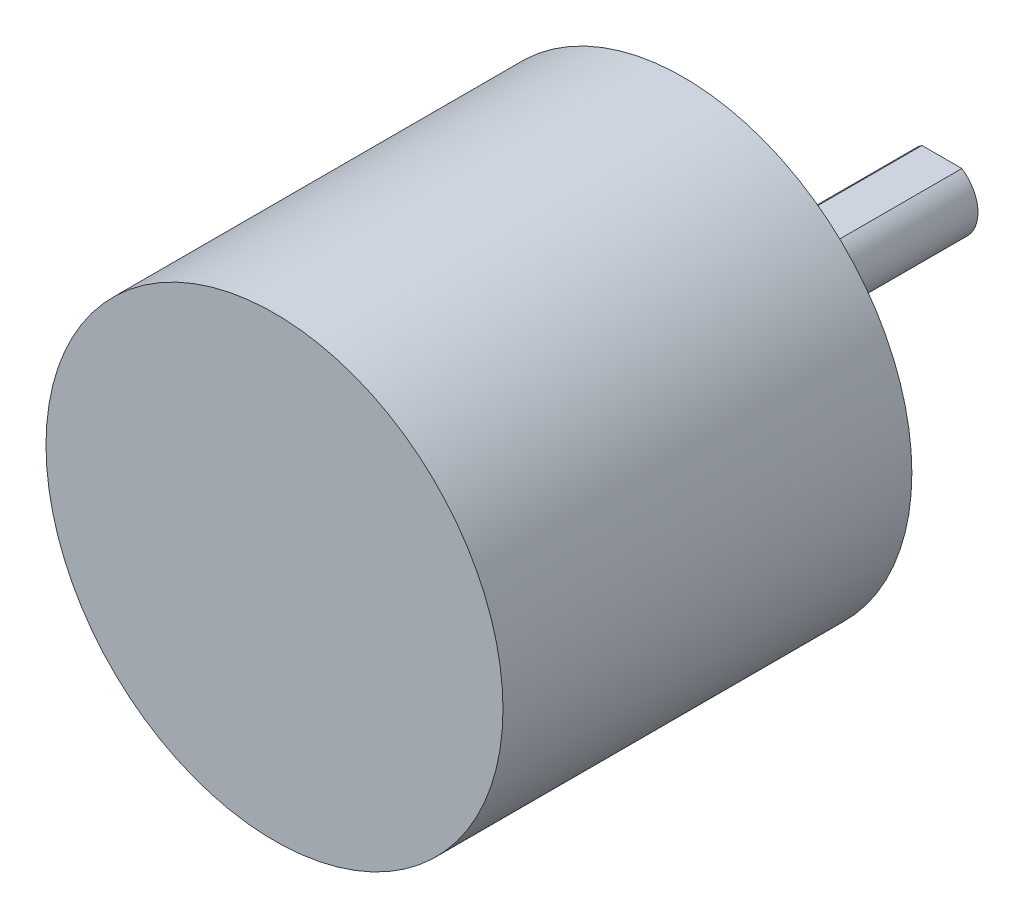
ISO-10303-21;
HEADER;
FILE_DESCRIPTION(('STEP AP214'),'2;1');
FILE_NAME('part.step','',(''),(''),'','','');
FILE_SCHEMA(('AUTOMOTIVE_DESIGN { 1 0 10303 214 1 1 1 1 }'));
ENDSEC;
DATA;
#1=APPLICATION_CONTEXT('core data for automotive mechanical design processes');
#2=APPLICATION_PROTOCOL_DEFINITION('international standard','automotive_design',2000,#1);
#3=PRODUCT_CONTEXT('',#1,'mechanical');
#4=PRODUCT('Part','Part','',(#3));
#5=PRODUCT_RELATED_PRODUCT_CATEGORY('part','',(#4));
#6=PRODUCT_DEFINITION_FORMATION('','',#4);
#7=PRODUCT_DEFINITION_CONTEXT('part definition',#1,'design');
#8=PRODUCT_DEFINITION('design','',#6,#7);
#9=PRODUCT_DEFINITION_SHAPE('','',#8);
#10=(LENGTH_UNIT() NAMED_UNIT(*) SI_UNIT(.MILLI.,.METRE.));
#11=(NAMED_UNIT(*) PLANE_ANGLE_UNIT() SI_UNIT($,.RADIAN.));
#12=(NAMED_UNIT(*) SI_UNIT($,.STERADIAN.) SOLID_ANGLE_UNIT());
#13=UNCERTAINTY_MEASURE_WITH_UNIT(LENGTH_MEASURE(1.E-05),#10,'distance_accuracy_value','');
#14=(GEOMETRIC_REPRESENTATION_CONTEXT(3) GLOBAL_UNCERTAINTY_ASSIGNED_CONTEXT((#13)) GLOBAL_UNIT_ASSIGNED_CONTEXT((#10,
#11,#12)) REPRESENTATION_CONTEXT('',''));
#15=CARTESIAN_POINT('',(0.,0.,0.));
#16=DIRECTION('',(0.,0.,1.));
#17=DIRECTION('',(1.,0.,0.));
#18=AXIS2_PLACEMENT_3D('',#15,#16,#17);
#19=CARTESIAN_POINT('',(0.,0.,34.));
#20=DIRECTION('',(0.,0.,-1.));
#21=DIRECTION('',(-1.,0.,0.));
#22=AXIS2_PLACEMENT_3D('',#19,#20,#21);
#23=CYLINDRICAL_SURFACE('',#22,19.);
#24=CARTESIAN_POINT('',(0.,0.,34.));
#25=DIRECTION('',(0.,0.,1.));
#26=DIRECTION('',(1.,0.,0.));
#27=AXIS2_PLACEMENT_3D('',#24,#25,#26);
#28=CIRCLE('',#27,19.);
#29=CARTESIAN_POINT('',(19.,0.,34.));
#30=VERTEX_POINT('',#29);
#31=EDGE_CURVE('E101',#30,#30,#28,.T.);
#32=ORIENTED_EDGE('',*,*,#31,.F.);
#33=EDGE_LOOP('',(#32));
#34=FACE_BOUND('',#33,.T.);
#35=CARTESIAN_POINT('',(0.,0.,0.));
#36=DIRECTION('',(0.,0.,1.));
#37=DIRECTION('',(1.,0.,0.));
#38=AXIS2_PLACEMENT_3D('',#35,#36,#37);
#39=CIRCLE('',#38,19.);
#40=CARTESIAN_POINT('',(19.,0.,0.));
#41=VERTEX_POINT('',#40);
#42=EDGE_CURVE('E41',#41,#41,#39,.T.);
#43=ORIENTED_EDGE('',*,*,#42,.T.);
#44=EDGE_LOOP('',(#43));
#45=FACE_BOUND('',#44,.T.);
#46=ADVANCED_FACE('F38',(#34,#45),#23,.T.);
#47=CARTESIAN_POINT('',(0.,0.,34.));
#48=DIRECTION('',(0.,0.,1.));
#49=DIRECTION('',(1.,0.,0.));
#50=AXIS2_PLACEMENT_3D('',#47,#48,#49);
#51=PLANE('',#50);
#52=ORIENTED_EDGE('',*,*,#31,.T.);
#53=EDGE_LOOP('',(#52));
#54=FACE_BOUND('',#53,.T.);
#55=ADVANCED_FACE('F114',(#54),#51,.T.);
#56=CARTESIAN_POINT('',(0.,0.,0.));
#57=DIRECTION('',(0.,0.,1.));
#58=DIRECTION('',(1.,0.,0.));
#59=AXIS2_PLACEMENT_3D('',#56,#57,#58);
#60=PLANE('',#59);
#61=CARTESIAN_POINT('',(0.,15.,0.));
#62=DIRECTION('',(0.,0.,-1.));
#63=DIRECTION('',(-1.,0.,0.));
#64=AXIS2_PLACEMENT_3D('',#61,#62,#63);
#65=CIRCLE('',#64,1.5);
#66=CARTESIAN_POINT('',(-1.5,15.,0.));
#67=VERTEX_POINT('',#66);
#68=EDGE_CURVE('E275',#67,#67,#65,.T.);
#69=ORIENTED_EDGE('',*,*,#68,.F.);
#70=EDGE_LOOP('',(#69));
#71=FACE_BOUND('',#70,.T.);
#72=CARTESIAN_POINT('',(12.9903810567666,-7.49999999999992,0.));
#73=DIRECTION('',(0.,0.,-1.));
#74=DIRECTION('',(-1.,0.,0.));
#75=AXIS2_PLACEMENT_3D('',#72,#73,#74);
#76=CIRCLE('',#75,1.5);
#77=CARTESIAN_POINT('',(11.4903810567666,-7.49999999999992,0.));
#78=VERTEX_POINT('',#77);
#79=EDGE_CURVE('E285',#78,#78,#76,.T.);
#80=ORIENTED_EDGE('',*,*,#79,.F.);
#81=EDGE_LOOP('',(#80));
#82=FACE_BOUND('',#81,.T.);
#83=CARTESIAN_POINT('',(-12.9903810567666,-7.50000000000001,0.));
#84=DIRECTION('',(0.,0.,-1.));
#85=DIRECTION('',(-1.,0.,0.));
#86=AXIS2_PLACEMENT_3D('',#83,#84,#85);
#87=CIRCLE('',#86,1.5);
#88=CARTESIAN_POINT('',(-14.4903810567666,-7.50000000000001,0.));
#89=VERTEX_POINT('',#88);
#90=EDGE_CURVE('E293',#89,#89,#87,.T.);
#91=ORIENTED_EDGE('',*,*,#90,.F.);
#92=EDGE_LOOP('',(#91));
#93=FACE_BOUND('',#92,.T.);
#94=CARTESIAN_POINT('',(0.,0.,0.));
#95=DIRECTION('',(0.,0.,-1.));
#96=DIRECTION('',(-1.,0.,0.));
#97=AXIS2_PLACEMENT_3D('',#94,#95,#96);
#98=CIRCLE('',#97,10.);
#99=CARTESIAN_POINT('',(-10.,0.,0.));
#100=VERTEX_POINT('',#99);
#101=EDGE_CURVE('E95',#100,#100,#98,.T.);
#102=ORIENTED_EDGE('',*,*,#101,.F.);
#103=EDGE_LOOP('',(#102));
#104=FACE_BOUND('',#103,.T.);
#105=ORIENTED_EDGE('',*,*,#42,.F.);
#106=EDGE_LOOP('',(#105));
#107=FACE_BOUND('',#106,.T.);
#108=ADVANCED_FACE('F111',(#71,#82,#93,#104,#107),#60,.F.);
#109=CARTESIAN_POINT('',(0.,0.,-5.));
#110=DIRECTION('',(0.,0.,1.));
#111=DIRECTION('',(1.,0.,0.));
#112=AXIS2_PLACEMENT_3D('',#109,#110,#111);
#113=CYLINDRICAL_SURFACE('',#112,10.);
#114=CARTESIAN_POINT('',(0.,0.,-5.));
#115=DIRECTION('',(0.,0.,-1.));
#116=DIRECTION('',(-1.,0.,0.));
#117=AXIS2_PLACEMENT_3D('',#114,#115,#116);
#118=CIRCLE('',#117,10.);
#119=CARTESIAN_POINT('',(-10.,0.,-5.));
#120=VERTEX_POINT('',#119);
#121=EDGE_CURVE('E88',#120,#120,#118,.T.);
#122=ORIENTED_EDGE('',*,*,#121,.F.);
#123=EDGE_LOOP('',(#122));
#124=FACE_BOUND('',#123,.T.);
#125=ORIENTED_EDGE('',*,*,#101,.T.);
#126=EDGE_LOOP('',(#125));
#127=FACE_BOUND('',#126,.T.);
#128=ADVANCED_FACE('F113',(#124,#127),#113,.T.);
#129=CARTESIAN_POINT('',(0.,0.,-5.));
#130=DIRECTION('',(0.,0.,-1.));
#131=DIRECTION('',(-1.,0.,0.));
#132=AXIS2_PLACEMENT_3D('',#129,#130,#131);
#133=PLANE('',#132);
#134=CARTESIAN_POINT('',(0.,0.,-5.));
#135=DIRECTION('',(0.,0.,-1.));
#136=DIRECTION('',(-1.,0.,0.));
#137=AXIS2_PLACEMENT_3D('',#134,#135,#136);
#138=CIRCLE('',#137,4.);
#139=CARTESIAN_POINT('',(-4.,0.,-5.));
#140=VERTEX_POINT('',#139);
#141=EDGE_CURVE('E47',#140,#140,#138,.T.);
#142=ORIENTED_EDGE('',*,*,#141,.F.);
#143=EDGE_LOOP('',(#142));
#144=FACE_BOUND('',#143,.T.);
#145=ORIENTED_EDGE('',*,*,#121,.T.);
#146=EDGE_LOOP('',(#145));
#147=FACE_BOUND('',#146,.T.);
#148=ADVANCED_FACE('F120',(#144,#147),#133,.T.);
#149=CARTESIAN_POINT('',(0.,0.,-6.));
#150=DIRECTION('',(0.,0.,1.));
#151=DIRECTION('',(1.,0.,0.));
#152=AXIS2_PLACEMENT_3D('',#149,#150,#151);
#153=CYLINDRICAL_SURFACE('',#152,4.);
#154=CARTESIAN_POINT('',(0.,0.,-6.));
#155=DIRECTION('',(0.,0.,-1.));
#156=DIRECTION('',(-1.,0.,0.));
#157=AXIS2_PLACEMENT_3D('',#154,#155,#156);
#158=CIRCLE('',#157,4.);
#159=CARTESIAN_POINT('',(-4.,0.,-6.));
#160=VERTEX_POINT('',#159);
#161=EDGE_CURVE('E84',#160,#160,#158,.T.);
#162=ORIENTED_EDGE('',*,*,#161,.F.);
#163=EDGE_LOOP('',(#162));
#164=FACE_BOUND('',#163,.T.);
#165=ORIENTED_EDGE('',*,*,#141,.T.);
#166=EDGE_LOOP('',(#165));
#167=FACE_BOUND('',#166,.T.);
#168=ADVANCED_FACE('F150',(#164,#167),#153,.T.);
#169=CARTESIAN_POINT('',(0.,0.,-6.));
#170=DIRECTION('',(0.,0.,-1.));
#171=DIRECTION('',(-1.,0.,0.));
#172=AXIS2_PLACEMENT_3D('',#169,#170,#171);
#173=PLANE('',#172);
#174=CARTESIAN_POINT('',(0.,0.,-6.));
#175=DIRECTION('',(0.,0.,-1.));
#176=DIRECTION('',(-1.,0.,0.));
#177=AXIS2_PLACEMENT_3D('',#174,#175,#176);
#178=CIRCLE('',#177,3.);
#179=CARTESIAN_POINT('',(-3.,0.,-6.));
#180=VERTEX_POINT('',#179);
#181=EDGE_CURVE('E11',#180,#180,#178,.T.);
#182=ORIENTED_EDGE('',*,*,#181,.F.);
#183=EDGE_LOOP('',(#182));
#184=FACE_BOUND('',#183,.T.);
#185=ORIENTED_EDGE('',*,*,#161,.T.);
#186=EDGE_LOOP('',(#185));
#187=FACE_BOUND('',#186,.T.);
#188=ADVANCED_FACE('F160',(#184,#187),#173,.T.);
#189=CARTESIAN_POINT('',(0.,0.,-21.5));
#190=DIRECTION('',(0.,0.,1.));
#191=DIRECTION('',(1.,0.,0.));
#192=AXIS2_PLACEMENT_3D('',#189,#190,#191);
#193=CYLINDRICAL_SURFACE('',#192,3.);
#194=CARTESIAN_POINT('',(0.,0.,-21.5));
#195=DIRECTION('',(0.,0.,-1.));
#196=DIRECTION('',(-1.,0.,0.));
#197=AXIS2_PLACEMENT_3D('',#194,#195,#196);
#198=CIRCLE('',#197,3.);
#199=CARTESIAN_POINT('',(1.6583123951777,2.5,-21.5));
#200=VERTEX_POINT('',#199);
#201=CARTESIAN_POINT('',(-1.6583123951777,2.5,-21.5));
#202=VERTEX_POINT('',#201);
#203=EDGE_CURVE('E79',#200,#202,#198,.T.);
#204=ORIENTED_EDGE('',*,*,#203,.F.);
#205=DIRECTION('',(0.,0.,-1.));
#206=VECTOR('',#205,1.);
#207=CARTESIAN_POINT('',(1.6583123951777,2.5,-9.5));
#208=LINE('',#207,#206);
#209=CARTESIAN_POINT('',(1.6583123951777,2.5,-9.5));
#210=VERTEX_POINT('',#209);
#211=EDGE_CURVE('E55',#210,#200,#208,.T.);
#212=ORIENTED_EDGE('',*,*,#211,.F.);
#213=CARTESIAN_POINT('',(0.,0.,-9.5));
#214=DIRECTION('',(0.,0.,-1.));
#215=DIRECTION('',(-1.,0.,0.));
#216=AXIS2_PLACEMENT_3D('',#213,#214,#215);
#217=CIRCLE('',#216,3.);
#218=CARTESIAN_POINT('',(-1.6583123951777,2.5,-9.5));
#219=VERTEX_POINT('',#218);
#220=EDGE_CURVE('E72',#219,#210,#217,.T.);
#221=ORIENTED_EDGE('',*,*,#220,.F.);
#222=DIRECTION('',(0.,0.,-1.));
#223=VECTOR('',#222,1.);
#224=CARTESIAN_POINT('',(-1.6583123951777,2.5,-9.5));
#225=LINE('',#224,#223);
#226=EDGE_CURVE('E61',#219,#202,#225,.T.);
#227=ORIENTED_EDGE('',*,*,#226,.T.);
#228=EDGE_LOOP('',(#204,#212,#221,#227));
#229=FACE_BOUND('',#228,.T.);
#230=ORIENTED_EDGE('',*,*,#181,.T.);
#231=EDGE_LOOP('',(#230));
#232=FACE_BOUND('',#231,.T.);
#233=ADVANCED_FACE('F77',(#229,#232),#193,.T.);
#234=CARTESIAN_POINT('',(0.,0.,-21.5));
#235=DIRECTION('',(0.,0.,-1.));
#236=DIRECTION('',(-1.,0.,0.));
#237=AXIS2_PLACEMENT_3D('',#234,#235,#236);
#238=PLANE('',#237);
#239=DIRECTION('',(-1.,0.,0.));
#240=VECTOR('',#239,1.);
#241=CARTESIAN_POINT('',(0.,2.5,-21.5));
#242=LINE('',#241,#240);
#243=EDGE_CURVE('E66',#200,#202,#242,.T.);
#244=ORIENTED_EDGE('',*,*,#243,.F.);
#245=ORIENTED_EDGE('',*,*,#203,.T.);
#246=EDGE_LOOP('',(#244,#245));
#247=FACE_BOUND('',#246,.T.);
#248=ADVANCED_FACE('F82',(#247),#238,.T.);
#249=CARTESIAN_POINT('',(0.,2.5,-9.5));
#250=DIRECTION('',(0.,-1.,0.));
#251=DIRECTION('',(0.,0.,-1.));
#252=AXIS2_PLACEMENT_3D('',#249,#250,#251);
#253=PLANE('',#252);
#254=ORIENTED_EDGE('',*,*,#243,.T.);
#255=ORIENTED_EDGE('',*,*,#226,.F.);
#256=DIRECTION('',(-1.,0.,0.));
#257=VECTOR('',#256,1.);
#258=CARTESIAN_POINT('',(0.,2.5,-9.5));
#259=LINE('',#258,#257);
#260=EDGE_CURVE('E299',#210,#219,#259,.T.);
#261=ORIENTED_EDGE('',*,*,#260,.F.);
#262=ORIENTED_EDGE('',*,*,#211,.T.);
#263=EDGE_LOOP('',(#254,#255,#261,#262));
#264=FACE_BOUND('',#263,.T.);
#265=ADVANCED_FACE('F67',(#264),#253,.F.);
#266=CARTESIAN_POINT('',(0.,0.,-9.5));
#267=DIRECTION('',(0.,0.,-1.));
#268=DIRECTION('',(-1.,0.,0.));
#269=AXIS2_PLACEMENT_3D('',#266,#267,#268);
#270=PLANE('',#269);
#271=ORIENTED_EDGE('',*,*,#220,.T.);
#272=ORIENTED_EDGE('',*,*,#260,.T.);
#273=EDGE_LOOP('',(#271,#272));
#274=FACE_BOUND('',#273,.T.);
#275=ADVANCED_FACE('F195',(#274),#270,.T.);
#276=CARTESIAN_POINT('',(-12.9903810567666,-7.50000000000001,6.));
#277=DIRECTION('',(0.,0.,-1.));
#278=DIRECTION('',(-1.,0.,0.));
#279=AXIS2_PLACEMENT_3D('',#276,#277,#278);
#280=CYLINDRICAL_SURFACE('',#279,1.5);
#281=CARTESIAN_POINT('',(-12.9903810567666,-7.50000000000001,6.));
#282=DIRECTION('',(0.,0.,-1.));
#283=DIRECTION('',(-1.,0.,0.));
#284=AXIS2_PLACEMENT_3D('',#281,#282,#283);
#285=CIRCLE('',#284,1.5);
#286=CARTESIAN_POINT('',(-14.4903810567666,-7.50000000000001,6.));
#287=VERTEX_POINT('',#286);
#288=EDGE_CURVE('E289',#287,#287,#285,.T.);
#289=ORIENTED_EDGE('',*,*,#288,.F.);
#290=EDGE_LOOP('',(#289));
#291=FACE_BOUND('',#290,.T.);
#292=ORIENTED_EDGE('',*,*,#90,.T.);
#293=EDGE_LOOP('',(#292));
#294=FACE_BOUND('',#293,.T.);
#295=ADVANCED_FACE('F204',(#291,#294),#280,.F.);
#296=CARTESIAN_POINT('',(-12.9903810567666,-7.50000000000001,6.));
#297=DIRECTION('',(0.,0.,-1.));
#298=DIRECTION('',(-1.,0.,0.));
#299=AXIS2_PLACEMENT_3D('',#296,#297,#298);
#300=PLANE('',#299);
#301=ORIENTED_EDGE('',*,*,#288,.T.);
#302=EDGE_LOOP('',(#301));
#303=FACE_BOUND('',#302,.T.);
#304=ADVANCED_FACE('F218',(#303),#300,.T.);
#305=CARTESIAN_POINT('',(12.9903810567666,-7.49999999999992,6.));
#306=DIRECTION('',(0.,0.,-1.));
#307=DIRECTION('',(-1.,0.,0.));
#308=AXIS2_PLACEMENT_3D('',#305,#306,#307);
#309=CYLINDRICAL_SURFACE('',#308,1.5);
#310=CARTESIAN_POINT('',(12.9903810567666,-7.49999999999992,6.));
#311=DIRECTION('',(0.,0.,-1.));
#312=DIRECTION('',(-1.,0.,0.));
#313=AXIS2_PLACEMENT_3D('',#310,#311,#312);
#314=CIRCLE('',#313,1.5);
#315=CARTESIAN_POINT('',(11.4903810567666,-7.49999999999992,6.));
#316=VERTEX_POINT('',#315);
#317=EDGE_CURVE('E279',#316,#316,#314,.T.);
#318=ORIENTED_EDGE('',*,*,#317,.F.);
#319=EDGE_LOOP('',(#318));
#320=FACE_BOUND('',#319,.T.);
#321=ORIENTED_EDGE('',*,*,#79,.T.);
#322=EDGE_LOOP('',(#321));
#323=FACE_BOUND('',#322,.T.);
#324=ADVANCED_FACE('F228',(#320,#323),#309,.F.);
#325=CARTESIAN_POINT('',(12.9903810567666,-7.49999999999992,6.));
#326=DIRECTION('',(0.,0.,-1.));
#327=DIRECTION('',(-1.,0.,0.));
#328=AXIS2_PLACEMENT_3D('',#325,#326,#327);
#329=PLANE('',#328);
#330=ORIENTED_EDGE('',*,*,#317,.T.);
#331=EDGE_LOOP('',(#330));
#332=FACE_BOUND('',#331,.T.);
#333=ADVANCED_FACE('F238',(#332),#329,.T.);
#334=CARTESIAN_POINT('',(0.,15.,6.));
#335=DIRECTION('',(0.,0.,-1.));
#336=DIRECTION('',(-1.,0.,0.));
#337=AXIS2_PLACEMENT_3D('',#334,#335,#336);
#338=CYLINDRICAL_SURFACE('',#337,1.5);
#339=CARTESIAN_POINT('',(0.,15.,6.));
#340=DIRECTION('',(0.,0.,-1.));
#341=DIRECTION('',(-1.,0.,0.));
#342=AXIS2_PLACEMENT_3D('',#339,#340,#341);
#343=CIRCLE('',#342,1.5);
#344=CARTESIAN_POINT('',(-1.5,15.,6.));
#345=VERTEX_POINT('',#344);
#346=EDGE_CURVE('E73',#345,#345,#343,.T.);
#347=ORIENTED_EDGE('',*,*,#346,.F.);
#348=EDGE_LOOP('',(#347));
#349=FACE_BOUND('',#348,.T.);
#350=ORIENTED_EDGE('',*,*,#68,.T.);
#351=EDGE_LOOP('',(#350));
#352=FACE_BOUND('',#351,.T.);
#353=ADVANCED_FACE('F248',(#349,#352),#338,.F.);
#354=CARTESIAN_POINT('',(0.,15.,6.));
#355=DIRECTION('',(0.,0.,-1.));
#356=DIRECTION('',(-1.,0.,0.));
#357=AXIS2_PLACEMENT_3D('',#354,#355,#356);
#358=PLANE('',#357);
#359=ORIENTED_EDGE('',*,*,#346,.T.);
#360=EDGE_LOOP('',(#359));
#361=FACE_BOUND('',#360,.T.);
#362=ADVANCED_FACE('F258',(#361),#358,.T.);
#363=CLOSED_SHELL('',(#46,#55,#108,#128,#148,#168,#188,#233,#248,#265,#275,#295,#304,#324,#333,
#353,#362));
#364=MANIFOLD_SOLID_BREP('B2',#363);
#365=ADVANCED_BREP_SHAPE_REPRESENTATION('',(#18,#364),#14);
#366=SHAPE_DEFINITION_REPRESENTATION(#9,#365);
ENDSEC;
END-ISO-10303-21;
